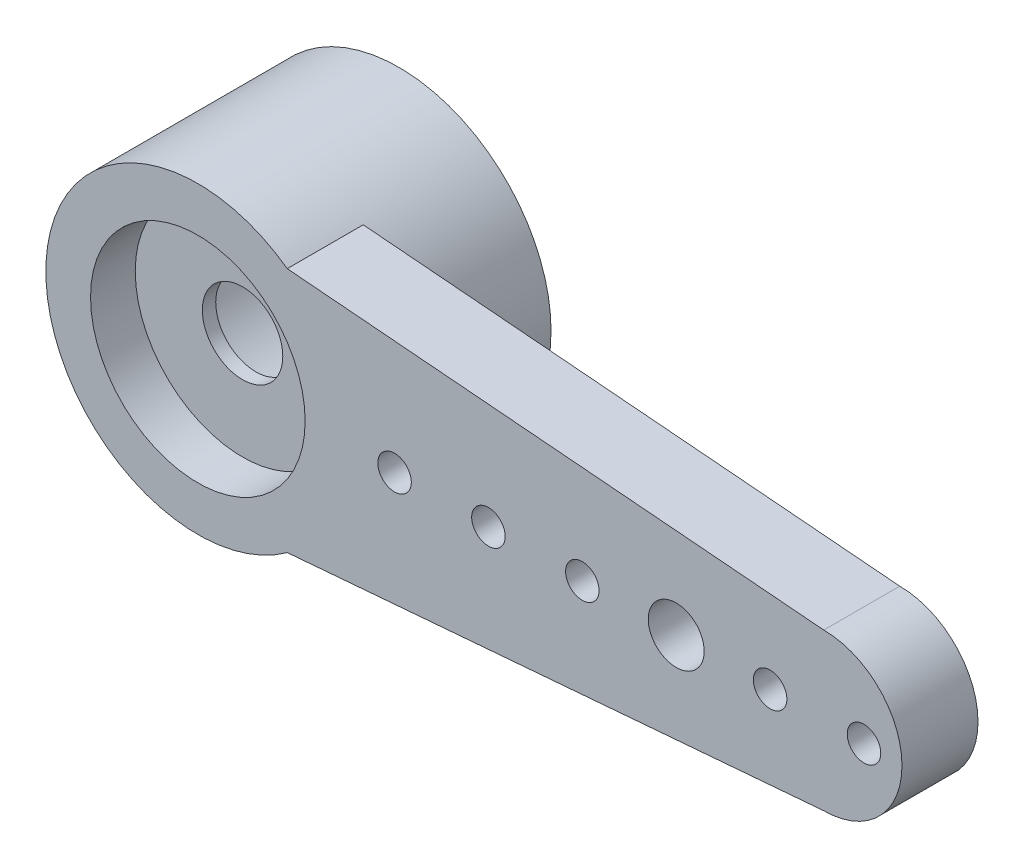
ISO-10303-21;
HEADER;
FILE_DESCRIPTION(('STEP AP214'),'2;1');
FILE_NAME('part.step','',(''),(''),'','','');
FILE_SCHEMA(('AUTOMOTIVE_DESIGN { 1 0 10303 214 1 1 1 1 }'));
ENDSEC;
DATA;
#1=APPLICATION_CONTEXT('core data for automotive mechanical design processes');
#2=APPLICATION_PROTOCOL_DEFINITION('international standard','automotive_design',2000,#1);
#3=PRODUCT_CONTEXT('',#1,'mechanical');
#4=PRODUCT('Part','Part','',(#3));
#5=PRODUCT_RELATED_PRODUCT_CATEGORY('part','',(#4));
#6=PRODUCT_DEFINITION_FORMATION('','',#4);
#7=PRODUCT_DEFINITION_CONTEXT('part definition',#1,'design');
#8=PRODUCT_DEFINITION('design','',#6,#7);
#9=PRODUCT_DEFINITION_SHAPE('','',#8);
#10=(LENGTH_UNIT() NAMED_UNIT(*) SI_UNIT(.MILLI.,.METRE.));
#11=(NAMED_UNIT(*) PLANE_ANGLE_UNIT() SI_UNIT($,.RADIAN.));
#12=(NAMED_UNIT(*) SI_UNIT($,.STERADIAN.) SOLID_ANGLE_UNIT());
#13=UNCERTAINTY_MEASURE_WITH_UNIT(LENGTH_MEASURE(1.E-05),#10,'distance_accuracy_value','');
#14=(GEOMETRIC_REPRESENTATION_CONTEXT(3) GLOBAL_UNCERTAINTY_ASSIGNED_CONTEXT((#13)) GLOBAL_UNIT_ASSIGNED_CONTEXT((#10,
#11,#12)) REPRESENTATION_CONTEXT('',''));
#15=CARTESIAN_POINT('',(0.,0.,0.));
#16=DIRECTION('',(0.,0.,1.));
#17=DIRECTION('',(1.,0.,0.));
#18=AXIS2_PLACEMENT_3D('',#15,#16,#17);
#19=CARTESIAN_POINT('',(12.8,0.,1.73933982822018));
#20=DIRECTION('',(0.,0.,1.));
#21=DIRECTION('',(1.,0.,0.));
#22=AXIS2_PLACEMENT_3D('',#19,#20,#21);
#23=CYLINDRICAL_SURFACE('',#22,0.375);
#24=CARTESIAN_POINT('',(12.8,0.,2.8));
#25=DIRECTION('',(0.,0.,1.));
#26=DIRECTION('',(1.,0.,0.));
#27=AXIS2_PLACEMENT_3D('',#24,#25,#26);
#28=CIRCLE('',#27,0.375);
#29=CARTESIAN_POINT('',(13.175,0.,2.8));
#30=VERTEX_POINT('',#29);
#31=EDGE_CURVE('E42',#30,#30,#28,.F.);
#32=ORIENTED_EDGE('',*,*,#31,.T.);
#33=EDGE_LOOP('',(#32));
#34=FACE_BOUND('',#33,.T.);
#35=CARTESIAN_POINT('',(12.8,0.,4.5));
#36=DIRECTION('',(0.,0.,1.));
#37=DIRECTION('',(1.,0.,0.));
#38=AXIS2_PLACEMENT_3D('',#35,#36,#37);
#39=CIRCLE('',#38,0.375);
#40=CARTESIAN_POINT('',(13.175,0.,4.5));
#41=VERTEX_POINT('',#40);
#42=EDGE_CURVE('E11',#41,#41,#39,.T.);
#43=ORIENTED_EDGE('',*,*,#42,.T.);
#44=EDGE_LOOP('',(#43));
#45=FACE_BOUND('',#44,.T.);
#46=ADVANCED_FACE('F35',(#34,#45),#23,.F.);
#47=CARTESIAN_POINT('',(8.6,0.,1.73933982822018));
#48=DIRECTION('',(0.,0.,1.));
#49=DIRECTION('',(1.,0.,0.));
#50=AXIS2_PLACEMENT_3D('',#47,#48,#49);
#51=CYLINDRICAL_SURFACE('',#50,0.375);
#52=CARTESIAN_POINT('',(8.6,0.,2.8));
#53=DIRECTION('',(0.,0.,1.));
#54=DIRECTION('',(1.,0.,0.));
#55=AXIS2_PLACEMENT_3D('',#52,#53,#54);
#56=CIRCLE('',#55,0.375);
#57=CARTESIAN_POINT('',(8.975,0.,2.8));
#58=VERTEX_POINT('',#57);
#59=EDGE_CURVE('E134',#58,#58,#56,.F.);
#60=ORIENTED_EDGE('',*,*,#59,.T.);
#61=EDGE_LOOP('',(#60));
#62=FACE_BOUND('',#61,.T.);
#63=CARTESIAN_POINT('',(8.6,0.,4.5));
#64=DIRECTION('',(0.,0.,1.));
#65=DIRECTION('',(1.,0.,0.));
#66=AXIS2_PLACEMENT_3D('',#63,#64,#65);
#67=CIRCLE('',#66,0.375);
#68=CARTESIAN_POINT('',(8.975,0.,4.5));
#69=VERTEX_POINT('',#68);
#70=EDGE_CURVE('E139',#69,#69,#67,.T.);
#71=ORIENTED_EDGE('',*,*,#70,.T.);
#72=EDGE_LOOP('',(#71));
#73=FACE_BOUND('',#72,.T.);
#74=ADVANCED_FACE('F162',(#62,#73),#51,.F.);
#75=CARTESIAN_POINT('',(0.,0.,4.5));
#76=DIRECTION('',(0.,0.,-1.));
#77=DIRECTION('',(-1.,0.,0.));
#78=AXIS2_PLACEMENT_3D('',#75,#76,#77);
#79=CYLINDRICAL_SURFACE('',#78,3.4);
#80=CARTESIAN_POINT('',(0.,0.,0.));
#81=DIRECTION('',(0.,0.,1.));
#82=DIRECTION('',(1.,0.,0.));
#83=AXIS2_PLACEMENT_3D('',#80,#81,#82);
#84=CIRCLE('',#83,3.4);
#85=CARTESIAN_POINT('',(3.4,0.,0.));
#86=VERTEX_POINT('',#85);
#87=EDGE_CURVE('E129',#86,#86,#84,.T.);
#88=ORIENTED_EDGE('',*,*,#87,.T.);
#89=EDGE_LOOP('',(#88));
#90=FACE_BOUND('',#89,.T.);
#91=DIRECTION('',(0.,0.,1.));
#92=VECTOR('',#91,1.);
#93=CARTESIAN_POINT('',(1.99937490231322,-2.75,2.8));
#94=LINE('',#93,#92);
#95=CARTESIAN_POINT('',(1.99937490231322,-2.75,2.8));
#96=VERTEX_POINT('',#95);
#97=CARTESIAN_POINT('',(1.99937490231322,-2.75,4.5));
#98=VERTEX_POINT('',#97);
#99=EDGE_CURVE('E109',#96,#98,#94,.T.);
#100=ORIENTED_EDGE('',*,*,#99,.T.);
#101=CARTESIAN_POINT('',(0.,0.,4.5));
#102=DIRECTION('',(0.,0.,1.));
#103=DIRECTION('',(1.,0.,0.));
#104=AXIS2_PLACEMENT_3D('',#101,#102,#103);
#105=CIRCLE('',#104,3.4);
#106=CARTESIAN_POINT('',(1.99937490231322,2.75,4.5));
#107=VERTEX_POINT('',#106);
#108=EDGE_CURVE('E132',#107,#98,#105,.T.);
#109=ORIENTED_EDGE('',*,*,#108,.F.);
#110=DIRECTION('',(0.,0.,1.));
#111=VECTOR('',#110,1.);
#112=CARTESIAN_POINT('',(1.99937490231322,2.75,2.8));
#113=LINE('',#112,#111);
#114=CARTESIAN_POINT('',(1.99937490231322,2.75,2.8));
#115=VERTEX_POINT('',#114);
#116=EDGE_CURVE('E90',#115,#107,#113,.T.);
#117=ORIENTED_EDGE('',*,*,#116,.F.);
#118=CARTESIAN_POINT('',(0.,0.,2.8));
#119=DIRECTION('',(0.,0.,1.));
#120=DIRECTION('',(1.,0.,0.));
#121=AXIS2_PLACEMENT_3D('',#118,#119,#120);
#122=CIRCLE('',#121,3.4);
#123=EDGE_CURVE('E96',#96,#115,#122,.T.);
#124=ORIENTED_EDGE('',*,*,#123,.F.);
#125=EDGE_LOOP('',(#100,#109,#117,#124));
#126=FACE_BOUND('',#125,.T.);
#127=ADVANCED_FACE('F166',(#90,#126),#79,.T.);
#128=CARTESIAN_POINT('',(0.,0.,4.5));
#129=DIRECTION('',(0.,0.,1.));
#130=DIRECTION('',(1.,0.,0.));
#131=AXIS2_PLACEMENT_3D('',#128,#129,#130);
#132=PLANE('',#131);
#133=CARTESIAN_POINT('',(10.7,0.,4.5));
#134=DIRECTION('',(0.,0.,1.));
#135=DIRECTION('',(1.,0.,0.));
#136=AXIS2_PLACEMENT_3D('',#133,#134,#135);
#137=CIRCLE('',#136,0.625000000000001);
#138=CARTESIAN_POINT('',(11.325,0.,4.5));
#139=VERTEX_POINT('',#138);
#140=EDGE_CURVE('E279',#139,#139,#137,.T.);
#141=ORIENTED_EDGE('',*,*,#140,.F.);
#142=EDGE_LOOP('',(#141));
#143=FACE_BOUND('',#142,.T.);
#144=CARTESIAN_POINT('',(14.9,0.,4.5));
#145=DIRECTION('',(0.,0.,1.));
#146=DIRECTION('',(1.,0.,0.));
#147=AXIS2_PLACEMENT_3D('',#144,#145,#146);
#148=CIRCLE('',#147,0.375);
#149=CARTESIAN_POINT('',(15.275,0.,4.5));
#150=VERTEX_POINT('',#149);
#151=EDGE_CURVE('E281',#150,#150,#148,.T.);
#152=ORIENTED_EDGE('',*,*,#151,.F.);
#153=EDGE_LOOP('',(#152));
#154=FACE_BOUND('',#153,.T.);
#155=CARTESIAN_POINT('',(6.5,0.,4.5));
#156=DIRECTION('',(0.,0.,1.));
#157=DIRECTION('',(1.,0.,0.));
#158=AXIS2_PLACEMENT_3D('',#155,#156,#157);
#159=CIRCLE('',#158,0.375);
#160=CARTESIAN_POINT('',(6.875,0.,4.5));
#161=VERTEX_POINT('',#160);
#162=EDGE_CURVE('E292',#161,#161,#159,.T.);
#163=ORIENTED_EDGE('',*,*,#162,.F.);
#164=EDGE_LOOP('',(#163));
#165=FACE_BOUND('',#164,.T.);
#166=CARTESIAN_POINT('',(4.4,0.,4.5));
#167=DIRECTION('',(0.,0.,1.));
#168=DIRECTION('',(1.,0.,0.));
#169=AXIS2_PLACEMENT_3D('',#166,#167,#168);
#170=CIRCLE('',#169,0.375);
#171=CARTESIAN_POINT('',(4.775,0.,4.5));
#172=VERTEX_POINT('',#171);
#173=EDGE_CURVE('E295',#172,#172,#170,.T.);
#174=ORIENTED_EDGE('',*,*,#173,.F.);
#175=EDGE_LOOP('',(#174));
#176=FACE_BOUND('',#175,.T.);
#177=CARTESIAN_POINT('',(0.,0.,4.5));
#178=DIRECTION('',(0.,0.,1.));
#179=DIRECTION('',(1.,0.,0.));
#180=AXIS2_PLACEMENT_3D('',#177,#178,#179);
#181=CIRCLE('',#180,2.4);
#182=CARTESIAN_POINT('',(2.4,0.,4.5));
#183=VERTEX_POINT('',#182);
#184=EDGE_CURVE('E119',#183,#183,#181,.T.);
#185=ORIENTED_EDGE('',*,*,#184,.F.);
#186=EDGE_LOOP('',(#185));
#187=FACE_BOUND('',#186,.T.);
#188=ORIENTED_EDGE('',*,*,#108,.T.);
#189=DIRECTION('',(-0.996546116227703,-0.0830411839479759,0.));
#190=VECTOR('',#189,1.);
#191=CARTESIAN_POINT('',(0.241361881603777,-2.89649345399919,4.5));
#192=LINE('',#191,#190);
#193=CARTESIAN_POINT('',(14.,-1.75,4.5));
#194=VERTEX_POINT('',#193);
#195=EDGE_CURVE('E74',#194,#98,#192,.T.);
#196=ORIENTED_EDGE('',*,*,#195,.F.);
#197=CARTESIAN_POINT('',(14.,0.,4.5));
#198=DIRECTION('',(0.,0.,1.));
#199=DIRECTION('',(1.,0.,0.));
#200=AXIS2_PLACEMENT_3D('',#197,#198,#199);
#201=CIRCLE('',#200,1.75);
#202=CARTESIAN_POINT('',(14.,1.75,4.5));
#203=VERTEX_POINT('',#202);
#204=EDGE_CURVE('E105',#194,#203,#201,.T.);
#205=ORIENTED_EDGE('',*,*,#204,.T.);
#206=DIRECTION('',(-0.996546116227703,0.0830411839479759,0.));
#207=VECTOR('',#206,1.);
#208=CARTESIAN_POINT('',(0.241361881603777,2.89649345399919,4.5));
#209=LINE('',#208,#207);
#210=EDGE_CURVE('E49',#203,#107,#209,.T.);
#211=ORIENTED_EDGE('',*,*,#210,.T.);
#212=EDGE_LOOP('',(#188,#196,#205,#211));
#213=FACE_BOUND('',#212,.T.);
#214=ORIENTED_EDGE('',*,*,#70,.F.);
#215=EDGE_LOOP('',(#214));
#216=FACE_BOUND('',#215,.T.);
#217=ORIENTED_EDGE('',*,*,#42,.F.);
#218=EDGE_LOOP('',(#217));
#219=FACE_BOUND('',#218,.T.);
#220=ADVANCED_FACE('F171',(#143,#154,#165,#176,#187,#213,#216,#219),#132,.T.);
#221=CARTESIAN_POINT('',(0.,0.,0.));
#222=DIRECTION('',(0.,0.,1.));
#223=DIRECTION('',(1.,0.,0.));
#224=AXIS2_PLACEMENT_3D('',#221,#222,#223);
#225=PLANE('',#224);
#226=CARTESIAN_POINT('',(0.,0.,0.));
#227=DIRECTION('',(0.,0.,-1.));
#228=DIRECTION('',(-1.,0.,0.));
#229=AXIS2_PLACEMENT_3D('',#226,#227,#228);
#230=CIRCLE('',#229,2.25);
#231=CARTESIAN_POINT('',(-2.25,0.,0.));
#232=VERTEX_POINT('',#231);
#233=EDGE_CURVE('E123',#232,#232,#230,.T.);
#234=ORIENTED_EDGE('',*,*,#233,.F.);
#235=EDGE_LOOP('',(#234));
#236=FACE_BOUND('',#235,.T.);
#237=ORIENTED_EDGE('',*,*,#87,.F.);
#238=EDGE_LOOP('',(#237));
#239=FACE_BOUND('',#238,.T.);
#240=ADVANCED_FACE('F176',(#236,#239),#225,.F.);
#241=CARTESIAN_POINT('',(0.,0.,3.2));
#242=DIRECTION('',(0.,0.,-1.));
#243=DIRECTION('',(-1.,0.,0.));
#244=AXIS2_PLACEMENT_3D('',#241,#242,#243);
#245=CYLINDRICAL_SURFACE('',#244,2.25);
#246=CARTESIAN_POINT('',(0.,0.,3.2));
#247=DIRECTION('',(0.,0.,-1.));
#248=DIRECTION('',(-1.,0.,0.));
#249=AXIS2_PLACEMENT_3D('',#246,#247,#248);
#250=CIRCLE('',#249,2.25);
#251=CARTESIAN_POINT('',(-2.25,0.,3.2));
#252=VERTEX_POINT('',#251);
#253=EDGE_CURVE('E126',#252,#252,#250,.T.);
#254=ORIENTED_EDGE('',*,*,#253,.F.);
#255=EDGE_LOOP('',(#254));
#256=FACE_BOUND('',#255,.T.);
#257=ORIENTED_EDGE('',*,*,#233,.T.);
#258=EDGE_LOOP('',(#257));
#259=FACE_BOUND('',#258,.T.);
#260=ADVANCED_FACE('F179',(#256,#259),#245,.F.);
#261=CARTESIAN_POINT('',(0.,0.,3.2));
#262=DIRECTION('',(0.,0.,-1.));
#263=DIRECTION('',(-1.,0.,0.));
#264=AXIS2_PLACEMENT_3D('',#261,#262,#263);
#265=PLANE('',#264);
#266=CARTESIAN_POINT('',(0.,0.,3.2));
#267=DIRECTION('',(0.,0.,-1.));
#268=DIRECTION('',(-1.,0.,0.));
#269=AXIS2_PLACEMENT_3D('',#266,#267,#268);
#270=CIRCLE('',#269,0.9);
#271=CARTESIAN_POINT('',(-0.9,0.,3.2));
#272=VERTEX_POINT('',#271);
#273=EDGE_CURVE('E116',#272,#272,#270,.F.);
#274=ORIENTED_EDGE('',*,*,#273,.T.);
#275=EDGE_LOOP('',(#274));
#276=FACE_BOUND('',#275,.T.);
#277=ORIENTED_EDGE('',*,*,#253,.T.);
#278=EDGE_LOOP('',(#277));
#279=FACE_BOUND('',#278,.T.);
#280=ADVANCED_FACE('F186',(#276,#279),#265,.T.);
#281=CARTESIAN_POINT('',(0.,0.,3.5));
#282=DIRECTION('',(0.,0.,1.));
#283=DIRECTION('',(1.,0.,0.));
#284=AXIS2_PLACEMENT_3D('',#281,#282,#283);
#285=CYLINDRICAL_SURFACE('',#284,2.4);
#286=CARTESIAN_POINT('',(0.,0.,3.5));
#287=DIRECTION('',(0.,0.,1.));
#288=DIRECTION('',(1.,0.,0.));
#289=AXIS2_PLACEMENT_3D('',#286,#287,#288);
#290=CIRCLE('',#289,2.4);
#291=CARTESIAN_POINT('',(2.4,0.,3.5));
#292=VERTEX_POINT('',#291);
#293=EDGE_CURVE('E120',#292,#292,#290,.T.);
#294=ORIENTED_EDGE('',*,*,#293,.F.);
#295=EDGE_LOOP('',(#294));
#296=FACE_BOUND('',#295,.T.);
#297=ORIENTED_EDGE('',*,*,#184,.T.);
#298=EDGE_LOOP('',(#297));
#299=FACE_BOUND('',#298,.T.);
#300=ADVANCED_FACE('F190',(#296,#299),#285,.F.);
#301=CARTESIAN_POINT('',(0.,0.,3.5));
#302=DIRECTION('',(0.,0.,1.));
#303=DIRECTION('',(1.,0.,0.));
#304=AXIS2_PLACEMENT_3D('',#301,#302,#303);
#305=PLANE('',#304);
#306=CARTESIAN_POINT('',(0.,0.,3.5));
#307=DIRECTION('',(0.,0.,1.));
#308=DIRECTION('',(1.,0.,0.));
#309=AXIS2_PLACEMENT_3D('',#306,#307,#308);
#310=CIRCLE('',#309,0.9);
#311=CARTESIAN_POINT('',(0.9,0.,3.5));
#312=VERTEX_POINT('',#311);
#313=EDGE_CURVE('E111',#312,#312,#310,.T.);
#314=ORIENTED_EDGE('',*,*,#313,.F.);
#315=EDGE_LOOP('',(#314));
#316=FACE_BOUND('',#315,.T.);
#317=ORIENTED_EDGE('',*,*,#293,.T.);
#318=EDGE_LOOP('',(#317));
#319=FACE_BOUND('',#318,.T.);
#320=ADVANCED_FACE('F194',(#316,#319),#305,.T.);
#321=CARTESIAN_POINT('',(0.,0.,0.654415587728429));
#322=DIRECTION('',(0.,0.,1.));
#323=DIRECTION('',(1.,0.,0.));
#324=AXIS2_PLACEMENT_3D('',#321,#322,#323);
#325=CYLINDRICAL_SURFACE('',#324,0.9);
#326=ORIENTED_EDGE('',*,*,#313,.T.);
#327=EDGE_LOOP('',(#326));
#328=FACE_BOUND('',#327,.T.);
#329=ORIENTED_EDGE('',*,*,#273,.F.);
#330=EDGE_LOOP('',(#329));
#331=FACE_BOUND('',#330,.T.);
#332=ADVANCED_FACE('F198',(#328,#331),#325,.F.);
#333=CARTESIAN_POINT('',(0.241361881603777,-2.89649345399919,2.8));
#334=DIRECTION('',(-0.0830411839479759,0.996546116227703,0.));
#335=DIRECTION('',(-0.996546116227703,-0.0830411839479759,0.));
#336=AXIS2_PLACEMENT_3D('',#333,#334,#335);
#337=PLANE('',#336);
#338=ORIENTED_EDGE('',*,*,#195,.T.);
#339=ORIENTED_EDGE('',*,*,#99,.F.);
#340=DIRECTION('',(-0.996546116227703,-0.0830411839479759,0.));
#341=VECTOR('',#340,1.);
#342=CARTESIAN_POINT('',(0.241361881603777,-2.89649345399919,2.8));
#343=LINE('',#342,#341);
#344=CARTESIAN_POINT('',(14.,-1.75,2.8));
#345=VERTEX_POINT('',#344);
#346=EDGE_CURVE('E58',#345,#96,#343,.T.);
#347=ORIENTED_EDGE('',*,*,#346,.F.);
#348=DIRECTION('',(0.,0.,1.));
#349=VECTOR('',#348,1.);
#350=CARTESIAN_POINT('',(14.,-1.75,2.8));
#351=LINE('',#350,#349);
#352=EDGE_CURVE('E81',#345,#194,#351,.T.);
#353=ORIENTED_EDGE('',*,*,#352,.T.);
#354=EDGE_LOOP('',(#338,#339,#347,#353));
#355=FACE_BOUND('',#354,.T.);
#356=ADVANCED_FACE('F202',(#355),#337,.F.);
#357=CARTESIAN_POINT('',(0.241361881603777,2.89649345399919,2.8));
#358=DIRECTION('',(0.0830411839479759,0.996546116227703,0.));
#359=DIRECTION('',(-0.996546116227703,0.0830411839479759,0.));
#360=AXIS2_PLACEMENT_3D('',#357,#358,#359);
#361=PLANE('',#360);
#362=ORIENTED_EDGE('',*,*,#210,.F.);
#363=DIRECTION('',(0.,0.,1.));
#364=VECTOR('',#363,1.);
#365=CARTESIAN_POINT('',(14.,1.75,2.8));
#366=LINE('',#365,#364);
#367=CARTESIAN_POINT('',(14.,1.75,2.8));
#368=VERTEX_POINT('',#367);
#369=EDGE_CURVE('E85',#368,#203,#366,.T.);
#370=ORIENTED_EDGE('',*,*,#369,.F.);
#371=DIRECTION('',(-0.996546116227703,0.0830411839479759,0.));
#372=VECTOR('',#371,1.);
#373=CARTESIAN_POINT('',(0.241361881603777,2.89649345399919,2.8));
#374=LINE('',#373,#372);
#375=EDGE_CURVE('E88',#368,#115,#374,.T.);
#376=ORIENTED_EDGE('',*,*,#375,.T.);
#377=ORIENTED_EDGE('',*,*,#116,.T.);
#378=EDGE_LOOP('',(#362,#370,#376,#377));
#379=FACE_BOUND('',#378,.T.);
#380=ADVANCED_FACE('F87',(#379),#361,.T.);
#381=CARTESIAN_POINT('',(14.,0.,2.8));
#382=DIRECTION('',(0.,0.,1.));
#383=DIRECTION('',(1.,0.,0.));
#384=AXIS2_PLACEMENT_3D('',#381,#382,#383);
#385=CYLINDRICAL_SURFACE('',#384,1.75);
#386=ORIENTED_EDGE('',*,*,#204,.F.);
#387=ORIENTED_EDGE('',*,*,#352,.F.);
#388=CARTESIAN_POINT('',(14.,0.,2.8));
#389=DIRECTION('',(0.,0.,1.));
#390=DIRECTION('',(1.,0.,0.));
#391=AXIS2_PLACEMENT_3D('',#388,#389,#390);
#392=CIRCLE('',#391,1.75);
#393=EDGE_CURVE('E94',#345,#368,#392,.T.);
#394=ORIENTED_EDGE('',*,*,#393,.T.);
#395=ORIENTED_EDGE('',*,*,#369,.T.);
#396=EDGE_LOOP('',(#386,#387,#394,#395));
#397=FACE_BOUND('',#396,.T.);
#398=ADVANCED_FACE('F98',(#397),#385,.T.);
#399=CARTESIAN_POINT('',(0.,0.,2.8));
#400=DIRECTION('',(0.,0.,1.));
#401=DIRECTION('',(1.,0.,0.));
#402=AXIS2_PLACEMENT_3D('',#399,#400,#401);
#403=PLANE('',#402);
#404=CARTESIAN_POINT('',(10.7,0.,2.8));
#405=DIRECTION('',(0.,0.,1.));
#406=DIRECTION('',(1.,0.,0.));
#407=AXIS2_PLACEMENT_3D('',#404,#405,#406);
#408=CIRCLE('',#407,0.625000000000001);
#409=CARTESIAN_POINT('',(11.325,0.,2.8));
#410=VERTEX_POINT('',#409);
#411=EDGE_CURVE('E276',#410,#410,#408,.F.);
#412=ORIENTED_EDGE('',*,*,#411,.F.);
#413=EDGE_LOOP('',(#412));
#414=FACE_BOUND('',#413,.T.);
#415=CARTESIAN_POINT('',(14.9,0.,2.8));
#416=DIRECTION('',(0.,0.,1.));
#417=DIRECTION('',(1.,0.,0.));
#418=AXIS2_PLACEMENT_3D('',#415,#416,#417);
#419=CIRCLE('',#418,0.375);
#420=CARTESIAN_POINT('',(15.275,0.,2.8));
#421=VERTEX_POINT('',#420);
#422=EDGE_CURVE('E286',#421,#421,#419,.F.);
#423=ORIENTED_EDGE('',*,*,#422,.F.);
#424=EDGE_LOOP('',(#423));
#425=FACE_BOUND('',#424,.T.);
#426=CARTESIAN_POINT('',(6.5,0.,2.8));
#427=DIRECTION('',(0.,0.,1.));
#428=DIRECTION('',(1.,0.,0.));
#429=AXIS2_PLACEMENT_3D('',#426,#427,#428);
#430=CIRCLE('',#429,0.375);
#431=CARTESIAN_POINT('',(6.875,0.,2.8));
#432=VERTEX_POINT('',#431);
#433=EDGE_CURVE('E289',#432,#432,#430,.F.);
#434=ORIENTED_EDGE('',*,*,#433,.F.);
#435=EDGE_LOOP('',(#434));
#436=FACE_BOUND('',#435,.T.);
#437=CARTESIAN_POINT('',(4.4,0.,2.8));
#438=DIRECTION('',(0.,0.,1.));
#439=DIRECTION('',(1.,0.,0.));
#440=AXIS2_PLACEMENT_3D('',#437,#438,#439);
#441=CIRCLE('',#440,0.375);
#442=CARTESIAN_POINT('',(4.775,0.,2.8));
#443=VERTEX_POINT('',#442);
#444=EDGE_CURVE('E106',#443,#443,#441,.F.);
#445=ORIENTED_EDGE('',*,*,#444,.F.);
#446=EDGE_LOOP('',(#445));
#447=FACE_BOUND('',#446,.T.);
#448=ORIENTED_EDGE('',*,*,#346,.T.);
#449=ORIENTED_EDGE('',*,*,#123,.T.);
#450=ORIENTED_EDGE('',*,*,#375,.F.);
#451=ORIENTED_EDGE('',*,*,#393,.F.);
#452=EDGE_LOOP('',(#448,#449,#450,#451));
#453=FACE_BOUND('',#452,.T.);
#454=ORIENTED_EDGE('',*,*,#59,.F.);
#455=EDGE_LOOP('',(#454));
#456=FACE_BOUND('',#455,.T.);
#457=ORIENTED_EDGE('',*,*,#31,.F.);
#458=EDGE_LOOP('',(#457));
#459=FACE_BOUND('',#458,.T.);
#460=ADVANCED_FACE('F92',(#414,#425,#436,#447,#453,#456,#459),#403,.F.);
#461=CARTESIAN_POINT('',(4.4,0.,1.73933982822018));
#462=DIRECTION('',(0.,0.,1.));
#463=DIRECTION('',(1.,0.,0.));
#464=AXIS2_PLACEMENT_3D('',#461,#462,#463);
#465=CYLINDRICAL_SURFACE('',#464,0.375);
#466=ORIENTED_EDGE('',*,*,#444,.T.);
#467=EDGE_LOOP('',(#466));
#468=FACE_BOUND('',#467,.T.);
#469=ORIENTED_EDGE('',*,*,#173,.T.);
#470=EDGE_LOOP('',(#469));
#471=FACE_BOUND('',#470,.T.);
#472=ADVANCED_FACE('F147',(#468,#471),#465,.F.);
#473=CARTESIAN_POINT('',(6.5,0.,1.73933982822018));
#474=DIRECTION('',(0.,0.,1.));
#475=DIRECTION('',(1.,0.,0.));
#476=AXIS2_PLACEMENT_3D('',#473,#474,#475);
#477=CYLINDRICAL_SURFACE('',#476,0.375);
#478=ORIENTED_EDGE('',*,*,#433,.T.);
#479=EDGE_LOOP('',(#478));
#480=FACE_BOUND('',#479,.T.);
#481=ORIENTED_EDGE('',*,*,#162,.T.);
#482=EDGE_LOOP('',(#481));
#483=FACE_BOUND('',#482,.T.);
#484=ADVANCED_FACE('F154',(#480,#483),#477,.F.);
#485=CARTESIAN_POINT('',(14.9,0.,1.73933982822018));
#486=DIRECTION('',(0.,0.,1.));
#487=DIRECTION('',(1.,0.,0.));
#488=AXIS2_PLACEMENT_3D('',#485,#486,#487);
#489=CYLINDRICAL_SURFACE('',#488,0.375);
#490=ORIENTED_EDGE('',*,*,#422,.T.);
#491=EDGE_LOOP('',(#490));
#492=FACE_BOUND('',#491,.T.);
#493=ORIENTED_EDGE('',*,*,#151,.T.);
#494=EDGE_LOOP('',(#493));
#495=FACE_BOUND('',#494,.T.);
#496=ADVANCED_FACE('F239',(#492,#495),#489,.F.);
#497=CARTESIAN_POINT('',(10.7,0.,1.03223304703363));
#498=DIRECTION('',(0.,0.,1.));
#499=DIRECTION('',(1.,0.,0.));
#500=AXIS2_PLACEMENT_3D('',#497,#498,#499);
#501=CYLINDRICAL_SURFACE('',#500,0.625000000000001);
#502=ORIENTED_EDGE('',*,*,#411,.T.);
#503=EDGE_LOOP('',(#502));
#504=FACE_BOUND('',#503,.T.);
#505=ORIENTED_EDGE('',*,*,#140,.T.);
#506=EDGE_LOOP('',(#505));
#507=FACE_BOUND('',#506,.T.);
#508=ADVANCED_FACE('F249',(#504,#507),#501,.F.);
#509=CLOSED_SHELL('',(#46,#74,#127,#220,#240,#260,#280,#300,#320,#332,#356,#380,#398,#460,#472,
#484,#496,#508));
#510=MANIFOLD_SOLID_BREP('B2',#509);
#511=ADVANCED_BREP_SHAPE_REPRESENTATION('',(#18,#510),#14);
#512=SHAPE_DEFINITION_REPRESENTATION(#9,#511);
ENDSEC;
END-ISO-10303-21;
